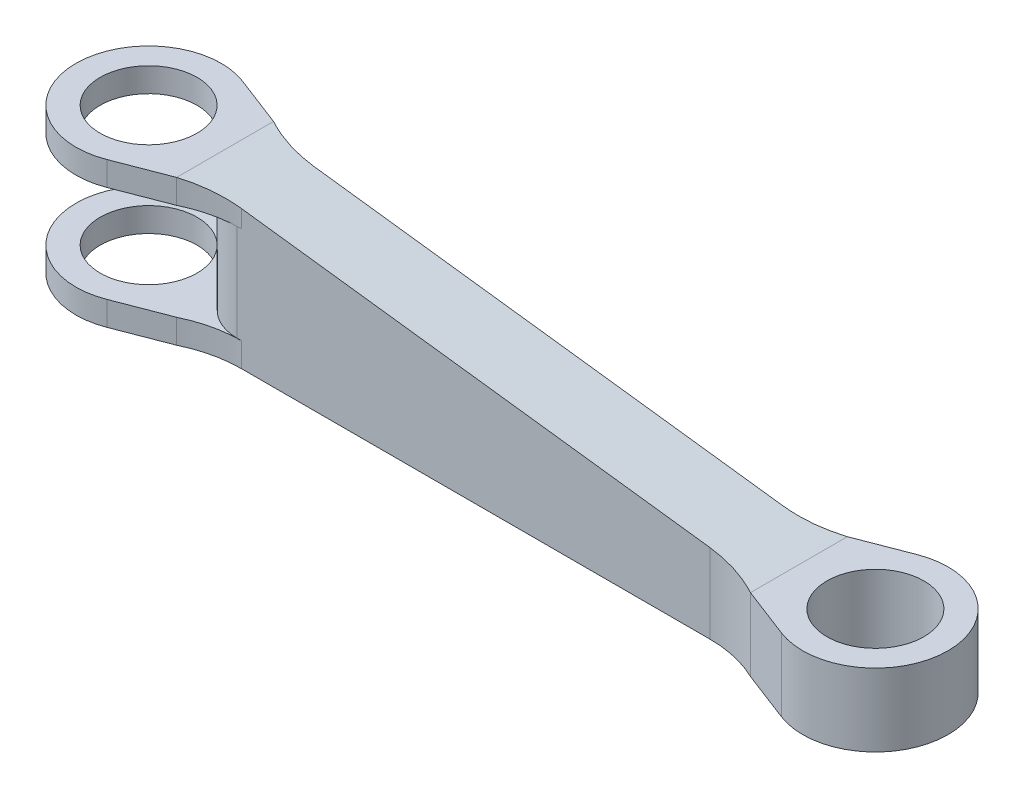
ISO-10303-21;
HEADER;
FILE_DESCRIPTION(('STEP AP214'),'2;1');
FILE_NAME('part.step','',(''),(''),'','','');
FILE_SCHEMA(('AUTOMOTIVE_DESIGN { 1 0 10303 214 1 1 1 1 }'));
ENDSEC;
DATA;
#1=APPLICATION_CONTEXT('core data for automotive mechanical design processes');
#2=APPLICATION_PROTOCOL_DEFINITION('international standard','automotive_design',2000,#1);
#3=PRODUCT_CONTEXT('',#1,'mechanical');
#4=PRODUCT('Part','Part','',(#3));
#5=PRODUCT_RELATED_PRODUCT_CATEGORY('part','',(#4));
#6=PRODUCT_DEFINITION_FORMATION('','',#4);
#7=PRODUCT_DEFINITION_CONTEXT('part definition',#1,'design');
#8=PRODUCT_DEFINITION('design','',#6,#7);
#9=PRODUCT_DEFINITION_SHAPE('','',#8);
#10=(LENGTH_UNIT() NAMED_UNIT(*) SI_UNIT(.MILLI.,.METRE.));
#11=(NAMED_UNIT(*) PLANE_ANGLE_UNIT() SI_UNIT($,.RADIAN.));
#12=(NAMED_UNIT(*) SI_UNIT($,.STERADIAN.) SOLID_ANGLE_UNIT());
#13=UNCERTAINTY_MEASURE_WITH_UNIT(LENGTH_MEASURE(1.E-05),#10,'distance_accuracy_value','');
#14=(GEOMETRIC_REPRESENTATION_CONTEXT(3) GLOBAL_UNCERTAINTY_ASSIGNED_CONTEXT((#13)) GLOBAL_UNIT_ASSIGNED_CONTEXT((#10,
#11,#12)) REPRESENTATION_CONTEXT('',''));
#15=CARTESIAN_POINT('',(0.,0.,0.));
#16=DIRECTION('',(0.,0.,1.));
#17=DIRECTION('',(1.,0.,0.));
#18=AXIS2_PLACEMENT_3D('',#15,#16,#17);
#19=CARTESIAN_POINT('',(0.,7.62,0.));
#20=DIRECTION('',(0.,-1.,0.));
#21=DIRECTION('',(0.,0.,-1.));
#22=AXIS2_PLACEMENT_3D('',#19,#20,#21);
#23=CYLINDRICAL_SURFACE('',#22,7.62);
#24=CARTESIAN_POINT('',(0.,-5.08,0.));
#25=DIRECTION('',(0.,-1.,0.));
#26=DIRECTION('',(0.,0.,-1.));
#27=AXIS2_PLACEMENT_3D('',#24,#25,#26);
#28=CIRCLE('',#27,7.62);
#29=CARTESIAN_POINT('',(2.73566372202433,-5.08,7.112));
#30=VERTEX_POINT('',#29);
#31=CARTESIAN_POINT('',(2.73566372202433,-5.08,-7.112));
#32=VERTEX_POINT('',#31);
#33=EDGE_CURVE('E184',#30,#32,#28,.T.);
#34=ORIENTED_EDGE('',*,*,#33,.T.);
#35=DIRECTION('',(0.,-1.,0.));
#36=VECTOR('',#35,1.);
#37=CARTESIAN_POINT('',(2.73566372202433,7.62,-7.112));
#38=LINE('',#37,#36);
#39=CARTESIAN_POINT('',(2.73566372202433,-7.62,-7.112));
#40=VERTEX_POINT('',#39);
#41=EDGE_CURVE('E338',#32,#40,#38,.T.);
#42=ORIENTED_EDGE('',*,*,#41,.T.);
#43=CARTESIAN_POINT('',(0.,-7.62,0.));
#44=DIRECTION('',(0.,1.,0.));
#45=DIRECTION('',(0.,0.,1.));
#46=AXIS2_PLACEMENT_3D('',#43,#44,#45);
#47=CIRCLE('',#46,7.62);
#48=CARTESIAN_POINT('',(2.73566372202433,-7.62,7.112));
#49=VERTEX_POINT('',#48);
#50=EDGE_CURVE('E333',#40,#49,#47,.T.);
#51=ORIENTED_EDGE('',*,*,#50,.T.);
#52=DIRECTION('',(0.,-1.,0.));
#53=VECTOR('',#52,1.);
#54=CARTESIAN_POINT('',(2.73566372202433,7.62,7.112));
#55=LINE('',#54,#53);
#56=EDGE_CURVE('E321',#30,#49,#55,.T.);
#57=ORIENTED_EDGE('',*,*,#56,.F.);
#58=EDGE_LOOP('',(#34,#42,#51,#57));
#59=FACE_BOUND('',#58,.T.);
#60=ADVANCED_FACE('F35',(#59),#23,.T.);
#61=CARTESIAN_POINT('',(2.73566372202433,7.62,7.112));
#62=DIRECTION('',(-0.359010987142301,0.,-0.933333333333333));
#63=DIRECTION('',(-0.933333333333333,0.,0.359010987142301));
#64=AXIS2_PLACEMENT_3D('',#61,#62,#63);
#65=PLANE('',#64);
#66=CARTESIAN_POINT('',(2.73566372202433,7.62,7.112));
#67=VERTEX_POINT('',#66);
#68=CARTESIAN_POINT('',(2.73566372202433,5.08,7.112));
#69=VERTEX_POINT('',#68);
#70=EDGE_CURVE('E256',#67,#69,#55,.T.);
#71=ORIENTED_EDGE('',*,*,#70,.T.);
#72=DIRECTION('',(0.933333333333333,0.,-0.359010987142301));
#73=VECTOR('',#72,1.);
#74=CARTESIAN_POINT('',(2.73566372202433,5.08,7.112));
#75=LINE('',#74,#73);
#76=CARTESIAN_POINT('',(8.01832470248509,5.08,5.08));
#77=VERTEX_POINT('',#76);
#78=EDGE_CURVE('E390',#69,#77,#75,.T.);
#79=ORIENTED_EDGE('',*,*,#78,.T.);
#80=DIRECTION('',(0.,-1.,0.));
#81=VECTOR('',#80,1.);
#82=CARTESIAN_POINT('',(8.01832470248509,7.62,5.08));
#83=LINE('',#82,#81);
#84=CARTESIAN_POINT('',(8.01832470248509,7.62,5.08));
#85=VERTEX_POINT('',#84);
#86=EDGE_CURVE('E196',#85,#77,#83,.T.);
#87=ORIENTED_EDGE('',*,*,#86,.F.);
#88=DIRECTION('',(0.933333333333333,0.,-0.359010987142301));
#89=VECTOR('',#88,1.);
#90=CARTESIAN_POINT('',(2.73566372202433,7.62,7.112));
#91=LINE('',#90,#89);
#92=EDGE_CURVE('E365',#67,#85,#91,.T.);
#93=ORIENTED_EDGE('',*,*,#92,.F.);
#94=EDGE_LOOP('',(#71,#79,#87,#93));
#95=FACE_BOUND('',#94,.T.);
#96=ADVANCED_FACE('F409',(#95),#65,.F.);
#97=CARTESIAN_POINT('',(2.73566372202433,7.62,-7.112));
#98=DIRECTION('',(-0.359010987142301,0.,0.933333333333333));
#99=DIRECTION('',(0.933333333333333,0.,0.359010987142301));
#100=AXIS2_PLACEMENT_3D('',#97,#98,#99);
#101=PLANE('',#100);
#102=DIRECTION('',(0.,-1.,0.));
#103=VECTOR('',#102,1.);
#104=CARTESIAN_POINT('',(8.01832470248509,7.62,-5.08));
#105=LINE('',#104,#103);
#106=CARTESIAN_POINT('',(8.01832470248509,7.62,-5.08));
#107=VERTEX_POINT('',#106);
#108=CARTESIAN_POINT('',(8.01832470248509,5.08,-5.08));
#109=VERTEX_POINT('',#108);
#110=EDGE_CURVE('E299',#107,#109,#105,.T.);
#111=ORIENTED_EDGE('',*,*,#110,.T.);
#112=DIRECTION('',(-0.933333333333333,0.,-0.359010987142301));
#113=VECTOR('',#112,1.);
#114=CARTESIAN_POINT('',(2.73566372202433,5.08,-7.112));
#115=LINE('',#114,#113);
#116=CARTESIAN_POINT('',(2.73566372202433,5.08,-7.112));
#117=VERTEX_POINT('',#116);
#118=EDGE_CURVE('E251',#109,#117,#115,.T.);
#119=ORIENTED_EDGE('',*,*,#118,.T.);
#120=CARTESIAN_POINT('',(2.73566372202433,7.62,-7.112));
#121=VERTEX_POINT('',#120);
#122=EDGE_CURVE('E312',#121,#117,#38,.T.);
#123=ORIENTED_EDGE('',*,*,#122,.F.);
#124=DIRECTION('',(-0.933333333333333,0.,-0.359010987142301));
#125=VECTOR('',#124,1.);
#126=CARTESIAN_POINT('',(2.73566372202433,7.62,-7.112));
#127=LINE('',#126,#125);
#128=EDGE_CURVE('E346',#107,#121,#127,.T.);
#129=ORIENTED_EDGE('',*,*,#128,.F.);
#130=EDGE_LOOP('',(#111,#119,#123,#129));
#131=FACE_BOUND('',#130,.T.);
#132=ADVANCED_FACE('F403',(#131),#101,.F.);
#133=CARTESIAN_POINT('',(0.,7.62,0.));
#134=DIRECTION('',(0.,-1.,0.));
#135=DIRECTION('',(0.,0.,-1.));
#136=AXIS2_PLACEMENT_3D('',#133,#134,#135);
#137=CYLINDRICAL_SURFACE('',#136,5.08);
#138=CARTESIAN_POINT('',(0.,5.08,0.));
#139=DIRECTION('',(0.,1.,0.));
#140=DIRECTION('',(0.,0.,1.));
#141=AXIS2_PLACEMENT_3D('',#138,#139,#140);
#142=CIRCLE('',#141,5.08);
#143=CARTESIAN_POINT('',(0.,5.08,-5.08));
#144=VERTEX_POINT('',#143);
#145=EDGE_CURVE('E187',#144,#144,#142,.T.);
#146=CARTESIAN_POINT('',(0.,7.62,0.));
#147=DIRECTION('',(0.,1.,0.));
#148=DIRECTION('',(0.,0.,1.));
#149=AXIS2_PLACEMENT_3D('',#146,#147,#148);
#150=CIRCLE('',#149,5.08);
#151=CARTESIAN_POINT('',(0.,7.62,-5.08));
#152=VERTEX_POINT('',#151);
#153=EDGE_CURVE('E340',#152,#152,#150,.T.);
#154=CARTESIAN_POINT('',(0.,5.08,-5.08));
#155=CARTESIAN_POINT('',(0.,5.10645833333333,-5.08));
#156=CARTESIAN_POINT('',(0.,5.13291666666667,-5.08));
#157=CARTESIAN_POINT('',(0.,5.18583333333333,-5.08));
#158=CARTESIAN_POINT('',(0.,5.21229166666667,-5.08));
#159=CARTESIAN_POINT('',(0.,5.26520833333333,-5.08));
#160=CARTESIAN_POINT('',(0.,5.29166666666667,-5.08));
#161=CARTESIAN_POINT('',(0.,5.34458333333333,-5.08));
#162=CARTESIAN_POINT('',(0.,5.37104166666667,-5.08));
#163=CARTESIAN_POINT('',(0.,5.42395833333333,-5.08));
#164=CARTESIAN_POINT('',(0.,5.45041666666667,-5.08));
#165=CARTESIAN_POINT('',(0.,5.50333333333333,-5.08));
#166=CARTESIAN_POINT('',(0.,5.52979166666667,-5.08));
#167=CARTESIAN_POINT('',(0.,5.58270833333333,-5.08));
#168=CARTESIAN_POINT('',(0.,5.60916666666667,-5.08));
#169=CARTESIAN_POINT('',(0.,5.66208333333333,-5.08));
#170=CARTESIAN_POINT('',(0.,5.68854166666667,-5.08));
#171=CARTESIAN_POINT('',(0.,5.74145833333333,-5.08));
#172=CARTESIAN_POINT('',(0.,5.76791666666667,-5.08));
#173=CARTESIAN_POINT('',(0.,5.82083333333333,-5.08));
#174=CARTESIAN_POINT('',(0.,5.84729166666667,-5.08));
#175=CARTESIAN_POINT('',(0.,5.90020833333333,-5.08));
#176=CARTESIAN_POINT('',(0.,5.92666666666667,-5.08));
#177=CARTESIAN_POINT('',(0.,5.97958333333333,-5.08));
#178=CARTESIAN_POINT('',(0.,6.00604166666667,-5.08));
#179=CARTESIAN_POINT('',(0.,6.05895833333333,-5.08));
#180=CARTESIAN_POINT('',(0.,6.08541666666667,-5.08));
#181=CARTESIAN_POINT('',(0.,6.13833333333333,-5.08));
#182=CARTESIAN_POINT('',(0.,6.16479166666667,-5.08));
#183=CARTESIAN_POINT('',(0.,6.21770833333333,-5.08));
#184=CARTESIAN_POINT('',(0.,6.24416666666667,-5.08));
#185=CARTESIAN_POINT('',(0.,6.29708333333333,-5.08));
#186=CARTESIAN_POINT('',(0.,6.32354166666667,-5.08));
#187=CARTESIAN_POINT('',(0.,6.37645833333333,-5.08));
#188=CARTESIAN_POINT('',(0.,6.40291666666667,-5.08));
#189=CARTESIAN_POINT('',(0.,6.45583333333333,-5.08));
#190=CARTESIAN_POINT('',(0.,6.48229166666667,-5.08));
#191=CARTESIAN_POINT('',(0.,6.53520833333333,-5.08));
#192=CARTESIAN_POINT('',(0.,6.56166666666667,-5.08));
#193=CARTESIAN_POINT('',(0.,6.61458333333333,-5.08));
#194=CARTESIAN_POINT('',(0.,6.64104166666667,-5.08));
#195=CARTESIAN_POINT('',(0.,6.69395833333333,-5.08));
#196=CARTESIAN_POINT('',(0.,6.72041666666667,-5.08));
#197=CARTESIAN_POINT('',(0.,6.77333333333333,-5.08));
#198=CARTESIAN_POINT('',(0.,6.79979166666667,-5.08));
#199=CARTESIAN_POINT('',(0.,6.85270833333333,-5.08));
#200=CARTESIAN_POINT('',(0.,6.87916666666667,-5.08));
#201=CARTESIAN_POINT('',(0.,6.93208333333333,-5.08));
#202=CARTESIAN_POINT('',(0.,6.95854166666667,-5.08));
#203=CARTESIAN_POINT('',(0.,7.01145833333333,-5.08));
#204=CARTESIAN_POINT('',(0.,7.03791666666667,-5.08));
#205=CARTESIAN_POINT('',(0.,7.09083333333333,-5.08));
#206=CARTESIAN_POINT('',(0.,7.11729166666667,-5.08));
#207=CARTESIAN_POINT('',(0.,7.17020833333333,-5.08));
#208=CARTESIAN_POINT('',(0.,7.19666666666667,-5.08));
#209=CARTESIAN_POINT('',(0.,7.24958333333333,-5.08));
#210=CARTESIAN_POINT('',(0.,7.27604166666667,-5.08));
#211=CARTESIAN_POINT('',(0.,7.32895833333333,-5.08));
#212=CARTESIAN_POINT('',(0.,7.35541666666667,-5.08));
#213=CARTESIAN_POINT('',(0.,7.40833333333333,-5.08));
#214=CARTESIAN_POINT('',(0.,7.43479166666667,-5.08));
#215=CARTESIAN_POINT('',(0.,7.48770833333333,-5.08));
#216=CARTESIAN_POINT('',(0.,7.51416666666667,-5.08));
#217=CARTESIAN_POINT('',(0.,7.56708333333333,-5.08));
#218=CARTESIAN_POINT('',(0.,7.59354166666667,-5.08));
#219=CARTESIAN_POINT('',(0.,7.62,-5.08));
#220=B_SPLINE_CURVE_WITH_KNOTS('',3,(#154,#155,#156,#157,#158,#159,#160,#161,#162,#163,#164,
#165,#166,#167,#168,#169,#170,#171,#172,#173,#174,#175,#176,#177,#178,#179,#180,#181,#182,#183,
#184,#185,#186,#187,#188,#189,#190,#191,#192,#193,#194,#195,#196,#197,#198,#199,#200,#201,#202,
#203,#204,#205,#206,#207,#208,#209,#210,#211,#212,#213,#214,#215,#216,#217,#218,#219),
.UNSPECIFIED.,.F.,.F.,(4,2,2,2,2,2,2,2,2,2,2,2,2,2,2,2,2,2,2,2,2,2,2,2,2,2,2,2,2,2,2,2,4),(0.,
0.0793749999999996,0.158749999999999,0.238125,0.3175,0.396875,0.476249999999999,0.555625,
0.634999999999999,0.714375,0.793749999999999,0.873125,0.952499999999999,1.031875,1.11125,
1.190625,1.27,1.349375,1.42875,1.508125,1.5875,1.666875,1.74625,1.825625,1.905,1.984375,2.06375,
2.143125,2.2225,2.301875,2.38125,2.460625,2.54),.UNSPECIFIED.);
#221=EDGE_CURVE('BSEAM462',#144,#152,#220,.T.);
#222=ORIENTED_EDGE('',*,*,#145,.F.);
#223=ORIENTED_EDGE('',*,*,#153,.T.);
#224=ORIENTED_EDGE('',*,*,#221,.T.);
#225=ORIENTED_EDGE('',*,*,#221,.F.);
#226=EDGE_LOOP('',(#222,#224,#223,#225));
#227=FACE_BOUND('',#226,.T.);
#228=ADVANCED_FACE('F462',(#227),#137,.F.);
#229=CARTESIAN_POINT('',(0.,7.62,0.));
#230=DIRECTION('',(0.,1.,0.));
#231=DIRECTION('',(0.,0.,1.));
#232=AXIS2_PLACEMENT_3D('',#229,#230,#231);
#233=PLANE('',#232);
#234=DIRECTION('',(0.,0.,1.));
#235=VECTOR('',#234,1.);
#236=CARTESIAN_POINT('',(8.01832470248509,7.62,-7.62));
#237=LINE('',#236,#235);
#238=EDGE_CURVE('E292',#107,#85,#237,.T.);
#239=ORIENTED_EDGE('',*,*,#238,.F.);
#240=ORIENTED_EDGE('',*,*,#128,.T.);
#241=CARTESIAN_POINT('',(0.,7.62,0.));
#242=DIRECTION('',(0.,1.,0.));
#243=DIRECTION('',(0.,0.,1.));
#244=AXIS2_PLACEMENT_3D('',#241,#242,#243);
#245=CIRCLE('',#244,7.62);
#246=EDGE_CURVE('E362',#121,#67,#245,.T.);
#247=ORIENTED_EDGE('',*,*,#246,.T.);
#248=ORIENTED_EDGE('',*,*,#92,.T.);
#249=EDGE_LOOP('',(#239,#240,#247,#248));
#250=FACE_BOUND('',#249,.T.);
#251=ORIENTED_EDGE('',*,*,#153,.F.);
#252=EDGE_LOOP('',(#251));
#253=FACE_BOUND('',#252,.T.);
#254=ADVANCED_FACE('F401',(#250,#253),#233,.T.);
#255=CARTESIAN_POINT('',(0.,-7.62,0.));
#256=DIRECTION('',(0.,1.,0.));
#257=DIRECTION('',(0.,0.,1.));
#258=AXIS2_PLACEMENT_3D('',#255,#256,#257);
#259=PLANE('',#258);
#260=CARTESIAN_POINT('',(0.,-7.62,0.));
#261=DIRECTION('',(0.,1.,0.));
#262=DIRECTION('',(0.,0.,1.));
#263=AXIS2_PLACEMENT_3D('',#260,#261,#262);
#264=CIRCLE('',#263,5.08);
#265=CARTESIAN_POINT('',(0.,-7.62,-5.08));
#266=VERTEX_POINT('',#265);
#267=EDGE_CURVE('E343',#266,#266,#264,.T.);
#268=ORIENTED_EDGE('',*,*,#267,.T.);
#269=EDGE_LOOP('',(#268));
#270=FACE_BOUND('',#269,.T.);
#271=ORIENTED_EDGE('',*,*,#50,.F.);
#272=DIRECTION('',(-0.933333333333333,0.,-0.359010987142301));
#273=VECTOR('',#272,1.);
#274=CARTESIAN_POINT('',(2.73566372202433,-7.62,-7.112));
#275=LINE('',#274,#273);
#276=CARTESIAN_POINT('',(8.01832470248509,-7.62,-5.08));
#277=VERTEX_POINT('',#276);
#278=EDGE_CURVE('E361',#277,#40,#275,.T.);
#279=ORIENTED_EDGE('',*,*,#278,.F.);
#280=CARTESIAN_POINT('',(13.5541263607818,-7.62,-16.51));
#281=DIRECTION('',(0.,1.,0.));
#282=DIRECTION('',(0.,0.,1.));
#283=AXIS2_PLACEMENT_3D('',#280,#281,#282);
#284=CIRCLE('',#283,12.7);
#285=CARTESIAN_POINT('',(13.5541263607818,-7.62,-3.81));
#286=VERTEX_POINT('',#285);
#287=EDGE_CURVE('E280',#277,#286,#284,.T.);
#288=ORIENTED_EDGE('',*,*,#287,.T.);
#289=DIRECTION('',(-1.,0.,0.));
#290=VECTOR('',#289,1.);
#291=CARTESIAN_POINT('',(8.01832470248509,-7.62,-3.81));
#292=LINE('',#291,#290);
#293=CARTESIAN_POINT('',(62.6458736392183,-7.62,-3.81));
#294=VERTEX_POINT('',#293);
#295=EDGE_CURVE('E360',#294,#286,#292,.T.);
#296=ORIENTED_EDGE('',*,*,#295,.F.);
#297=CARTESIAN_POINT('',(62.6458736392183,-7.62,-16.51));
#298=DIRECTION('',(0.,1.,0.));
#299=DIRECTION('',(0.,0.,1.));
#300=AXIS2_PLACEMENT_3D('',#297,#298,#299);
#301=CIRCLE('',#300,12.7);
#302=CARTESIAN_POINT('',(68.1816752975149,-7.62,-5.08));
#303=VERTEX_POINT('',#302);
#304=EDGE_CURVE('E276',#294,#303,#301,.T.);
#305=ORIENTED_EDGE('',*,*,#304,.T.);
#306=DIRECTION('',(-0.933333333333333,0.,0.359010987142301));
#307=VECTOR('',#306,1.);
#308=CARTESIAN_POINT('',(68.1816752975149,-7.62,-5.08));
#309=LINE('',#308,#307);
#310=CARTESIAN_POINT('',(73.4643362779757,-7.62,-7.112));
#311=VERTEX_POINT('',#310);
#312=EDGE_CURVE('E357',#311,#303,#309,.T.);
#313=ORIENTED_EDGE('',*,*,#312,.F.);
#314=CARTESIAN_POINT('',(76.2,-7.62,0.));
#315=DIRECTION('',(0.,1.,0.));
#316=DIRECTION('',(0.,0.,-1.));
#317=AXIS2_PLACEMENT_3D('',#314,#315,#316);
#318=CIRCLE('',#317,7.62);
#319=CARTESIAN_POINT('',(73.4643362779757,-7.62,7.112));
#320=VERTEX_POINT('',#319);
#321=EDGE_CURVE('E354',#320,#311,#318,.T.);
#322=ORIENTED_EDGE('',*,*,#321,.F.);
#323=DIRECTION('',(0.933333333333333,0.,0.359010987142301));
#324=VECTOR('',#323,1.);
#325=CARTESIAN_POINT('',(68.1816752975149,-7.62,5.08));
#326=LINE('',#325,#324);
#327=CARTESIAN_POINT('',(68.1816752975149,-7.62,5.08));
#328=VERTEX_POINT('',#327);
#329=EDGE_CURVE('E351',#328,#320,#326,.T.);
#330=ORIENTED_EDGE('',*,*,#329,.F.);
#331=CARTESIAN_POINT('',(62.6458736392183,-7.62,16.51));
#332=DIRECTION('',(0.,1.,0.));
#333=DIRECTION('',(0.,0.,1.));
#334=AXIS2_PLACEMENT_3D('',#331,#332,#333);
#335=CIRCLE('',#334,12.7);
#336=CARTESIAN_POINT('',(62.6458736392183,-7.62,3.81));
#337=VERTEX_POINT('',#336);
#338=EDGE_CURVE('E271',#328,#337,#335,.T.);
#339=ORIENTED_EDGE('',*,*,#338,.T.);
#340=DIRECTION('',(1.,0.,0.));
#341=VECTOR('',#340,1.);
#342=CARTESIAN_POINT('',(8.01832470248509,-7.62,3.81));
#343=LINE('',#342,#341);
#344=CARTESIAN_POINT('',(13.5541263607817,-7.62,3.81));
#345=VERTEX_POINT('',#344);
#346=EDGE_CURVE('E335',#345,#337,#343,.T.);
#347=ORIENTED_EDGE('',*,*,#346,.F.);
#348=CARTESIAN_POINT('',(13.5541263607817,-7.62,16.51));
#349=DIRECTION('',(0.,1.,0.));
#350=DIRECTION('',(0.,0.,1.));
#351=AXIS2_PLACEMENT_3D('',#348,#349,#350);
#352=CIRCLE('',#351,12.7);
#353=CARTESIAN_POINT('',(8.01832470248509,-7.62,5.08));
#354=VERTEX_POINT('',#353);
#355=EDGE_CURVE('E203',#345,#354,#352,.T.);
#356=ORIENTED_EDGE('',*,*,#355,.T.);
#357=DIRECTION('',(0.933333333333333,0.,-0.359010987142301));
#358=VECTOR('',#357,1.);
#359=CARTESIAN_POINT('',(2.73566372202433,-7.62,7.112));
#360=LINE('',#359,#358);
#361=EDGE_CURVE('E194',#49,#354,#360,.T.);
#362=ORIENTED_EDGE('',*,*,#361,.F.);
#363=EDGE_LOOP('',(#271,#279,#288,#296,#305,#313,#322,#330,#339,#347,#356,#362));
#364=FACE_BOUND('',#363,.T.);
#365=CARTESIAN_POINT('',(76.2,-7.62,0.));
#366=DIRECTION('',(0.,1.,0.));
#367=DIRECTION('',(0.,0.,1.));
#368=AXIS2_PLACEMENT_3D('',#365,#366,#367);
#369=CIRCLE('',#368,5.08);
#370=CARTESIAN_POINT('',(76.2,-7.62,-5.08));
#371=VERTEX_POINT('',#370);
#372=EDGE_CURVE('E371',#371,#371,#369,.T.);
#373=ORIENTED_EDGE('',*,*,#372,.T.);
#374=EDGE_LOOP('',(#373));
#375=FACE_BOUND('',#374,.T.);
#376=ADVANCED_FACE('F330',(#270,#364,#375),#259,.F.);
#377=ORIENTED_EDGE('',*,*,#122,.T.);
#378=CARTESIAN_POINT('',(0.,5.08,0.));
#379=DIRECTION('',(0.,1.,0.));
#380=DIRECTION('',(0.,0.,1.));
#381=AXIS2_PLACEMENT_3D('',#378,#379,#380);
#382=CIRCLE('',#381,7.62);
#383=EDGE_CURVE('E393',#117,#69,#382,.T.);
#384=ORIENTED_EDGE('',*,*,#383,.T.);
#385=ORIENTED_EDGE('',*,*,#70,.F.);
#386=ORIENTED_EDGE('',*,*,#246,.F.);
#387=EDGE_LOOP('',(#377,#384,#385,#386));
#388=FACE_BOUND('',#387,.T.);
#389=ADVANCED_FACE('F405',(#388),#23,.T.);
#390=CARTESIAN_POINT('',(8.01832470248509,-5.08,5.08));
#391=VERTEX_POINT('',#390);
#392=EDGE_CURVE('E191',#391,#354,#83,.T.);
#393=ORIENTED_EDGE('',*,*,#392,.F.);
#394=DIRECTION('',(-0.933333333333333,0.,0.359010987142301));
#395=VECTOR('',#394,1.);
#396=CARTESIAN_POINT('',(2.73566372202433,-5.08,7.112));
#397=LINE('',#396,#395);
#398=EDGE_CURVE('E177',#391,#30,#397,.T.);
#399=ORIENTED_EDGE('',*,*,#398,.T.);
#400=ORIENTED_EDGE('',*,*,#56,.T.);
#401=ORIENTED_EDGE('',*,*,#361,.T.);
#402=EDGE_LOOP('',(#393,#399,#400,#401));
#403=FACE_BOUND('',#402,.T.);
#404=ADVANCED_FACE('F192',(#403),#65,.F.);
#405=CARTESIAN_POINT('',(8.01832470248509,7.62,3.81));
#406=DIRECTION('',(0.,0.,-1.));
#407=DIRECTION('',(-1.,0.,0.));
#408=AXIS2_PLACEMENT_3D('',#405,#406,#407);
#409=PLANE('',#408);
#410=DIRECTION('',(-1.,0.,0.));
#411=VECTOR('',#410,1.);
#412=CARTESIAN_POINT('',(-7.62,5.08,3.81));
#413=LINE('',#412,#411);
#414=CARTESIAN_POINT('',(13.5541263607817,5.08,3.81));
#415=VERTEX_POINT('',#414);
#416=CARTESIAN_POINT('',(13.0983247024851,5.08,3.81));
#417=VERTEX_POINT('',#416);
#418=EDGE_CURVE('E252',#415,#417,#413,.T.);
#419=ORIENTED_EDGE('',*,*,#418,.T.);
#420=DIRECTION('',(0.,-1.,0.));
#421=VECTOR('',#420,1.);
#422=CARTESIAN_POINT('',(13.0983247024851,7.62,3.81));
#423=LINE('',#422,#421);
#424=CARTESIAN_POINT('',(13.0983247024851,-5.08,3.81));
#425=VERTEX_POINT('',#424);
#426=EDGE_CURVE('E215',#417,#425,#423,.T.);
#427=ORIENTED_EDGE('',*,*,#426,.T.);
#428=DIRECTION('',(1.,0.,0.));
#429=VECTOR('',#428,1.);
#430=CARTESIAN_POINT('',(-7.62,-5.08,3.81));
#431=LINE('',#430,#429);
#432=CARTESIAN_POINT('',(13.5541263607817,-5.08,3.81));
#433=VERTEX_POINT('',#432);
#434=EDGE_CURVE('E259',#425,#433,#431,.T.);
#435=ORIENTED_EDGE('',*,*,#434,.T.);
#436=DIRECTION('',(0.,-1.,0.));
#437=VECTOR('',#436,1.);
#438=CARTESIAN_POINT('',(13.5541263607817,7.62,3.81));
#439=LINE('',#438,#437);
#440=EDGE_CURVE('E201',#433,#345,#439,.T.);
#441=ORIENTED_EDGE('',*,*,#440,.T.);
#442=ORIENTED_EDGE('',*,*,#346,.T.);
#443=DIRECTION('',(0.,1.,0.));
#444=VECTOR('',#443,1.);
#445=CARTESIAN_POINT('',(62.6458736392183,7.62,3.81));
#446=LINE('',#445,#444);
#447=CARTESIAN_POINT('',(62.6458736392183,0.701137955566348,3.81));
#448=VERTEX_POINT('',#447);
#449=EDGE_CURVE('E262',#337,#448,#446,.T.);
#450=ORIENTED_EDGE('',*,*,#449,.T.);
#451=DIRECTION('',(-0.9920744596049,0.125651369270877,0.));
#452=VECTOR('',#451,1.);
#453=CARTESIAN_POINT('',(8.01832470248509,7.62,3.81));
#454=LINE('',#453,#452);
#455=CARTESIAN_POINT('',(13.5541263607817,6.91886204443365,3.81));
#456=VERTEX_POINT('',#455);
#457=EDGE_CURVE('E375',#448,#456,#454,.T.);
#458=ORIENTED_EDGE('',*,*,#457,.T.);
#459=DIRECTION('',(0.,-1.,0.));
#460=VECTOR('',#459,1.);
#461=CARTESIAN_POINT('',(13.5541263607817,7.62,3.81));
#462=LINE('',#461,#460);
#463=EDGE_CURVE('E255',#456,#415,#462,.T.);
#464=ORIENTED_EDGE('',*,*,#463,.T.);
#465=EDGE_LOOP('',(#419,#427,#435,#441,#442,#450,#458,#464));
#466=FACE_BOUND('',#465,.T.);
#467=ADVANCED_FACE('F417',(#466),#409,.F.);
#468=CARTESIAN_POINT('',(68.1816752975149,7.62,5.08));
#469=DIRECTION('',(0.359010987142301,0.,-0.933333333333333));
#470=DIRECTION('',(-0.933333333333333,0.,-0.359010987142301));
#471=AXIS2_PLACEMENT_3D('',#468,#469,#470);
#472=PLANE('',#471);
#473=DIRECTION('',(0.,-1.,0.));
#474=VECTOR('',#473,1.);
#475=CARTESIAN_POINT('',(73.4643362779757,7.62,7.112));
#476=LINE('',#475,#474);
#477=CARTESIAN_POINT('',(73.4643362779757,0.,7.112));
#478=VERTEX_POINT('',#477);
#479=EDGE_CURVE('E317',#478,#320,#476,.T.);
#480=ORIENTED_EDGE('',*,*,#479,.F.);
#481=DIRECTION('',(-0.933333333333333,0.,-0.359010987142301));
#482=VECTOR('',#481,1.);
#483=CARTESIAN_POINT('',(68.1816752975149,0.,5.08));
#484=LINE('',#483,#482);
#485=CARTESIAN_POINT('',(68.1816752975149,0.,5.08));
#486=VERTEX_POINT('',#485);
#487=EDGE_CURVE('E379',#478,#486,#484,.T.);
#488=ORIENTED_EDGE('',*,*,#487,.T.);
#489=DIRECTION('',(0.,-1.,0.));
#490=VECTOR('',#489,1.);
#491=CARTESIAN_POINT('',(68.1816752975149,7.62,5.08));
#492=LINE('',#491,#490);
#493=EDGE_CURVE('E197',#486,#328,#492,.T.);
#494=ORIENTED_EDGE('',*,*,#493,.T.);
#495=ORIENTED_EDGE('',*,*,#329,.T.);
#496=EDGE_LOOP('',(#480,#488,#494,#495));
#497=FACE_BOUND('',#496,.T.);
#498=ADVANCED_FACE('F476',(#497),#472,.F.);
#499=CARTESIAN_POINT('',(76.2,7.62,0.));
#500=DIRECTION('',(0.,-1.,0.));
#501=DIRECTION('',(0.,0.,-1.));
#502=AXIS2_PLACEMENT_3D('',#499,#500,#501);
#503=CYLINDRICAL_SURFACE('',#502,7.62);
#504=DIRECTION('',(0.,-1.,0.));
#505=VECTOR('',#504,1.);
#506=CARTESIAN_POINT('',(73.4643362779757,7.62,-7.112));
#507=LINE('',#506,#505);
#508=CARTESIAN_POINT('',(73.4643362779757,0.,-7.112));
#509=VERTEX_POINT('',#508);
#510=EDGE_CURVE('E309',#509,#311,#507,.T.);
#511=ORIENTED_EDGE('',*,*,#510,.F.);
#512=CARTESIAN_POINT('',(76.2,0.,0.));
#513=DIRECTION('',(0.,-1.,0.));
#514=DIRECTION('',(0.,0.,-1.));
#515=AXIS2_PLACEMENT_3D('',#512,#513,#514);
#516=CIRCLE('',#515,7.62);
#517=EDGE_CURVE('E382',#509,#478,#516,.T.);
#518=ORIENTED_EDGE('',*,*,#517,.T.);
#519=ORIENTED_EDGE('',*,*,#479,.T.);
#520=ORIENTED_EDGE('',*,*,#321,.T.);
#521=EDGE_LOOP('',(#511,#518,#519,#520));
#522=FACE_BOUND('',#521,.T.);
#523=ADVANCED_FACE('F473',(#522),#503,.T.);
#524=CARTESIAN_POINT('',(68.1816752975149,7.62,-5.08));
#525=DIRECTION('',(0.359010987142301,0.,0.933333333333333));
#526=DIRECTION('',(0.933333333333333,0.,-0.359010987142301));
#527=AXIS2_PLACEMENT_3D('',#524,#525,#526);
#528=PLANE('',#527);
#529=DIRECTION('',(0.,-1.,0.));
#530=VECTOR('',#529,1.);
#531=CARTESIAN_POINT('',(68.1816752975149,7.62,-5.08));
#532=LINE('',#531,#530);
#533=CARTESIAN_POINT('',(68.1816752975149,0.,-5.08));
#534=VERTEX_POINT('',#533);
#535=EDGE_CURVE('E305',#534,#303,#532,.T.);
#536=ORIENTED_EDGE('',*,*,#535,.F.);
#537=DIRECTION('',(0.933333333333333,0.,-0.359010987142301));
#538=VECTOR('',#537,1.);
#539=CARTESIAN_POINT('',(68.1816752975149,0.,-5.08));
#540=LINE('',#539,#538);
#541=EDGE_CURVE('E385',#534,#509,#540,.T.);
#542=ORIENTED_EDGE('',*,*,#541,.T.);
#543=ORIENTED_EDGE('',*,*,#510,.T.);
#544=ORIENTED_EDGE('',*,*,#312,.T.);
#545=EDGE_LOOP('',(#536,#542,#543,#544));
#546=FACE_BOUND('',#545,.T.);
#547=ADVANCED_FACE('F429',(#546),#528,.F.);
#548=CARTESIAN_POINT('',(8.01832470248509,7.62,-3.81));
#549=DIRECTION('',(0.,0.,1.));
#550=DIRECTION('',(1.,0.,0.));
#551=AXIS2_PLACEMENT_3D('',#548,#549,#550);
#552=PLANE('',#551);
#553=DIRECTION('',(-1.,0.,0.));
#554=VECTOR('',#553,1.);
#555=CARTESIAN_POINT('',(-7.62,-5.08,-3.81));
#556=LINE('',#555,#554);
#557=CARTESIAN_POINT('',(13.5541263607818,-5.08,-3.81));
#558=VERTEX_POINT('',#557);
#559=CARTESIAN_POINT('',(13.0983247024851,-5.08,-3.81));
#560=VERTEX_POINT('',#559);
#561=EDGE_CURVE('E222',#558,#560,#556,.T.);
#562=ORIENTED_EDGE('',*,*,#561,.T.);
#563=DIRECTION('',(0.,1.,0.));
#564=VECTOR('',#563,1.);
#565=CARTESIAN_POINT('',(13.0983247024851,7.62,-3.81));
#566=LINE('',#565,#564);
#567=CARTESIAN_POINT('',(13.0983247024851,5.08,-3.81));
#568=VERTEX_POINT('',#567);
#569=EDGE_CURVE('E212',#560,#568,#566,.T.);
#570=ORIENTED_EDGE('',*,*,#569,.T.);
#571=DIRECTION('',(1.,0.,0.));
#572=VECTOR('',#571,1.);
#573=CARTESIAN_POINT('',(-7.62,5.08,-3.81));
#574=LINE('',#573,#572);
#575=CARTESIAN_POINT('',(13.5541263607818,5.08,-3.81));
#576=VERTEX_POINT('',#575);
#577=EDGE_CURVE('E233',#568,#576,#574,.T.);
#578=ORIENTED_EDGE('',*,*,#577,.T.);
#579=DIRECTION('',(0.,1.,0.));
#580=VECTOR('',#579,1.);
#581=CARTESIAN_POINT('',(13.5541263607818,7.62,-3.81));
#582=LINE('',#581,#580);
#583=CARTESIAN_POINT('',(13.5541263607818,6.91886204443365,-3.81));
#584=VERTEX_POINT('',#583);
#585=EDGE_CURVE('E264',#576,#584,#582,.T.);
#586=ORIENTED_EDGE('',*,*,#585,.T.);
#587=DIRECTION('',(0.9920744596049,-0.125651369270877,0.));
#588=VECTOR('',#587,1.);
#589=CARTESIAN_POINT('',(8.01832470248509,7.62,-3.81));
#590=LINE('',#589,#588);
#591=CARTESIAN_POINT('',(62.6458736392183,0.701137955566348,-3.81));
#592=VERTEX_POINT('',#591);
#593=EDGE_CURVE('E295',#584,#592,#590,.T.);
#594=ORIENTED_EDGE('',*,*,#593,.T.);
#595=DIRECTION('',(0.,-1.,0.));
#596=VECTOR('',#595,1.);
#597=CARTESIAN_POINT('',(62.6458736392183,7.62,-3.81));
#598=LINE('',#597,#596);
#599=EDGE_CURVE('E268',#592,#294,#598,.T.);
#600=ORIENTED_EDGE('',*,*,#599,.T.);
#601=ORIENTED_EDGE('',*,*,#295,.T.);
#602=DIRECTION('',(0.,1.,0.));
#603=VECTOR('',#602,1.);
#604=CARTESIAN_POINT('',(13.5541263607818,7.62,-3.81));
#605=LINE('',#604,#603);
#606=EDGE_CURVE('E231',#286,#558,#605,.T.);
#607=ORIENTED_EDGE('',*,*,#606,.T.);
#608=EDGE_LOOP('',(#562,#570,#578,#586,#594,#600,#601,#607));
#609=FACE_BOUND('',#608,.T.);
#610=ADVANCED_FACE('F228',(#609),#552,.F.);
#611=ORIENTED_EDGE('',*,*,#41,.F.);
#612=DIRECTION('',(0.933333333333333,0.,0.359010987142301));
#613=VECTOR('',#612,1.);
#614=CARTESIAN_POINT('',(2.73566372202433,-5.08,-7.112));
#615=LINE('',#614,#613);
#616=CARTESIAN_POINT('',(8.01832470248509,-5.08,-5.08));
#617=VERTEX_POINT('',#616);
#618=EDGE_CURVE('E239',#32,#617,#615,.T.);
#619=ORIENTED_EDGE('',*,*,#618,.T.);
#620=EDGE_CURVE('E306',#617,#277,#105,.T.);
#621=ORIENTED_EDGE('',*,*,#620,.T.);
#622=ORIENTED_EDGE('',*,*,#278,.T.);
#623=EDGE_LOOP('',(#611,#619,#621,#622));
#624=FACE_BOUND('',#623,.T.);
#625=ADVANCED_FACE('F398',(#624),#101,.F.);
#626=CARTESIAN_POINT('',(0.,-5.08,0.));
#627=DIRECTION('',(0.,-1.,0.));
#628=DIRECTION('',(0.,0.,-1.));
#629=AXIS2_PLACEMENT_3D('',#626,#627,#628);
#630=CIRCLE('',#629,5.08);
#631=CARTESIAN_POINT('',(0.,-5.08,-5.08));
#632=VERTEX_POINT('',#631);
#633=EDGE_CURVE('E237',#632,#632,#630,.T.);
#634=CARTESIAN_POINT('',(0.,-5.08,-5.08));
#635=CARTESIAN_POINT('',(0.,-5.10645833333333,-5.08));
#636=CARTESIAN_POINT('',(0.,-5.13291666666667,-5.08));
#637=CARTESIAN_POINT('',(0.,-5.18583333333333,-5.08));
#638=CARTESIAN_POINT('',(0.,-5.21229166666667,-5.08));
#639=CARTESIAN_POINT('',(0.,-5.26520833333333,-5.08));
#640=CARTESIAN_POINT('',(0.,-5.29166666666667,-5.08));
#641=CARTESIAN_POINT('',(0.,-5.34458333333333,-5.08));
#642=CARTESIAN_POINT('',(0.,-5.37104166666667,-5.08));
#643=CARTESIAN_POINT('',(0.,-5.42395833333333,-5.08));
#644=CARTESIAN_POINT('',(0.,-5.45041666666667,-5.08));
#645=CARTESIAN_POINT('',(0.,-5.50333333333333,-5.08));
#646=CARTESIAN_POINT('',(0.,-5.52979166666667,-5.08));
#647=CARTESIAN_POINT('',(0.,-5.58270833333333,-5.08));
#648=CARTESIAN_POINT('',(0.,-5.60916666666667,-5.08));
#649=CARTESIAN_POINT('',(0.,-5.66208333333333,-5.08));
#650=CARTESIAN_POINT('',(0.,-5.68854166666667,-5.08));
#651=CARTESIAN_POINT('',(0.,-5.74145833333333,-5.08));
#652=CARTESIAN_POINT('',(0.,-5.76791666666667,-5.08));
#653=CARTESIAN_POINT('',(0.,-5.82083333333333,-5.08));
#654=CARTESIAN_POINT('',(0.,-5.84729166666667,-5.08));
#655=CARTESIAN_POINT('',(0.,-5.90020833333333,-5.08));
#656=CARTESIAN_POINT('',(0.,-5.92666666666667,-5.08));
#657=CARTESIAN_POINT('',(0.,-5.97958333333333,-5.08));
#658=CARTESIAN_POINT('',(0.,-6.00604166666667,-5.08));
#659=CARTESIAN_POINT('',(0.,-6.05895833333333,-5.08));
#660=CARTESIAN_POINT('',(0.,-6.08541666666667,-5.08));
#661=CARTESIAN_POINT('',(0.,-6.13833333333333,-5.08));
#662=CARTESIAN_POINT('',(0.,-6.16479166666667,-5.08));
#663=CARTESIAN_POINT('',(0.,-6.21770833333333,-5.08));
#664=CARTESIAN_POINT('',(0.,-6.24416666666667,-5.08));
#665=CARTESIAN_POINT('',(0.,-6.29708333333333,-5.08));
#666=CARTESIAN_POINT('',(0.,-6.32354166666667,-5.08));
#667=CARTESIAN_POINT('',(0.,-6.37645833333333,-5.08));
#668=CARTESIAN_POINT('',(0.,-6.40291666666667,-5.08));
#669=CARTESIAN_POINT('',(0.,-6.45583333333333,-5.08));
#670=CARTESIAN_POINT('',(0.,-6.48229166666667,-5.08));
#671=CARTESIAN_POINT('',(0.,-6.53520833333333,-5.08));
#672=CARTESIAN_POINT('',(0.,-6.56166666666667,-5.08));
#673=CARTESIAN_POINT('',(0.,-6.61458333333333,-5.08));
#674=CARTESIAN_POINT('',(0.,-6.64104166666667,-5.08));
#675=CARTESIAN_POINT('',(0.,-6.69395833333333,-5.08));
#676=CARTESIAN_POINT('',(0.,-6.72041666666667,-5.08));
#677=CARTESIAN_POINT('',(0.,-6.77333333333333,-5.08));
#678=CARTESIAN_POINT('',(0.,-6.79979166666667,-5.08));
#679=CARTESIAN_POINT('',(0.,-6.85270833333333,-5.08));
#680=CARTESIAN_POINT('',(0.,-6.87916666666667,-5.08));
#681=CARTESIAN_POINT('',(0.,-6.93208333333333,-5.08));
#682=CARTESIAN_POINT('',(0.,-6.95854166666667,-5.08));
#683=CARTESIAN_POINT('',(0.,-7.01145833333333,-5.08));
#684=CARTESIAN_POINT('',(0.,-7.03791666666667,-5.08));
#685=CARTESIAN_POINT('',(0.,-7.09083333333333,-5.08));
#686=CARTESIAN_POINT('',(0.,-7.11729166666667,-5.08));
#687=CARTESIAN_POINT('',(0.,-7.17020833333333,-5.08));
#688=CARTESIAN_POINT('',(0.,-7.19666666666667,-5.08));
#689=CARTESIAN_POINT('',(0.,-7.24958333333333,-5.08));
#690=CARTESIAN_POINT('',(0.,-7.27604166666667,-5.08));
#691=CARTESIAN_POINT('',(0.,-7.32895833333333,-5.08));
#692=CARTESIAN_POINT('',(0.,-7.35541666666667,-5.08));
#693=CARTESIAN_POINT('',(0.,-7.40833333333333,-5.08));
#694=CARTESIAN_POINT('',(0.,-7.43479166666667,-5.08));
#695=CARTESIAN_POINT('',(0.,-7.48770833333333,-5.08));
#696=CARTESIAN_POINT('',(0.,-7.51416666666667,-5.08));
#697=CARTESIAN_POINT('',(0.,-7.56708333333333,-5.08));
#698=CARTESIAN_POINT('',(0.,-7.59354166666667,-5.08));
#699=CARTESIAN_POINT('',(0.,-7.62,-5.08));
#700=B_SPLINE_CURVE_WITH_KNOTS('',3,(#634,#635,#636,#637,#638,#639,#640,#641,#642,#643,#644,
#645,#646,#647,#648,#649,#650,#651,#652,#653,#654,#655,#656,#657,#658,#659,#660,#661,#662,#663,
#664,#665,#666,#667,#668,#669,#670,#671,#672,#673,#674,#675,#676,#677,#678,#679,#680,#681,#682,
#683,#684,#685,#686,#687,#688,#689,#690,#691,#692,#693,#694,#695,#696,#697,#698,#699),
.UNSPECIFIED.,.F.,.F.,(4,2,2,2,2,2,2,2,2,2,2,2,2,2,2,2,2,2,2,2,2,2,2,2,2,2,2,2,2,2,2,2,4),(0.,
0.0793749999999996,0.158749999999999,0.238125,0.3175,0.396875,0.476250000000001,
0.555625000000001,0.635,0.714375,0.793749999999999,0.873125000000001,0.9525,1.031875,1.11125,
1.190625,1.27,1.349375,1.42875,1.508125,1.5875,1.666875,1.74625,1.825625,1.905,1.984375,2.06375,
2.143125,2.2225,2.301875,2.38125,2.460625,2.54),.UNSPECIFIED.);
#701=EDGE_CURVE('BSEAM468',#632,#266,#700,.T.);
#702=ORIENTED_EDGE('',*,*,#633,.F.);
#703=ORIENTED_EDGE('',*,*,#267,.F.);
#704=ORIENTED_EDGE('',*,*,#701,.T.);
#705=ORIENTED_EDGE('',*,*,#701,.F.);
#706=EDGE_LOOP('',(#702,#704,#703,#705));
#707=FACE_BOUND('',#706,.T.);
#708=ADVANCED_FACE('F468',(#707),#137,.F.);
#709=CARTESIAN_POINT('',(76.2,7.62,0.));
#710=DIRECTION('',(0.,-1.,0.));
#711=DIRECTION('',(0.,0.,-1.));
#712=AXIS2_PLACEMENT_3D('',#709,#710,#711);
#713=CYLINDRICAL_SURFACE('',#712,5.08);
#714=CARTESIAN_POINT('',(76.2,0.,0.));
#715=DIRECTION('',(0.,-1.,0.));
#716=DIRECTION('',(0.,0.,-1.));
#717=AXIS2_PLACEMENT_3D('',#714,#715,#716);
#718=CIRCLE('',#717,5.08);
#719=CARTESIAN_POINT('',(76.2,0.,-5.08));
#720=VERTEX_POINT('',#719);
#721=EDGE_CURVE('E247',#720,#720,#718,.T.);
#722=CARTESIAN_POINT('',(76.2,0.,-5.08));
#723=CARTESIAN_POINT('',(76.2,-0.0793749999999981,-5.08));
#724=CARTESIAN_POINT('',(76.2,-0.158749999999998,-5.08));
#725=CARTESIAN_POINT('',(76.2,-0.317499999999998,-5.08));
#726=CARTESIAN_POINT('',(76.2,-0.396874999999998,-5.08));
#727=CARTESIAN_POINT('',(76.2,-0.555624999999998,-5.08));
#728=CARTESIAN_POINT('',(76.2,-0.634999999999998,-5.08));
#729=CARTESIAN_POINT('',(76.2,-0.793749999999997,-5.08));
#730=CARTESIAN_POINT('',(76.2,-0.873124999999997,-5.08));
#731=CARTESIAN_POINT('',(76.2,-1.031875,-5.08));
#732=CARTESIAN_POINT('',(76.2,-1.11125,-5.08));
#733=CARTESIAN_POINT('',(76.2,-1.27,-5.08));
#734=CARTESIAN_POINT('',(76.2,-1.349375,-5.08));
#735=CARTESIAN_POINT('',(76.2,-1.508125,-5.08));
#736=CARTESIAN_POINT('',(76.2,-1.5875,-5.08));
#737=CARTESIAN_POINT('',(76.2,-1.74625,-5.08));
#738=CARTESIAN_POINT('',(76.2,-1.825625,-5.08));
#739=CARTESIAN_POINT('',(76.2,-1.984375,-5.08));
#740=CARTESIAN_POINT('',(76.2,-2.06375,-5.08));
#741=CARTESIAN_POINT('',(76.2,-2.2225,-5.08));
#742=CARTESIAN_POINT('',(76.2,-2.301875,-5.08));
#743=CARTESIAN_POINT('',(76.2,-2.460625,-5.08));
#744=CARTESIAN_POINT('',(76.2,-2.54,-5.08));
#745=CARTESIAN_POINT('',(76.2,-2.69875,-5.08));
#746=CARTESIAN_POINT('',(76.2,-2.778125,-5.08));
#747=CARTESIAN_POINT('',(76.2,-2.936875,-5.08));
#748=CARTESIAN_POINT('',(76.2,-3.01625,-5.08));
#749=CARTESIAN_POINT('',(76.2,-3.175,-5.08));
#750=CARTESIAN_POINT('',(76.2,-3.254375,-5.08));
#751=CARTESIAN_POINT('',(76.2,-3.413125,-5.08));
#752=CARTESIAN_POINT('',(76.2,-3.4925,-5.08));
#753=CARTESIAN_POINT('',(76.2,-3.65125,-5.08));
#754=CARTESIAN_POINT('',(76.2,-3.730625,-5.08));
#755=CARTESIAN_POINT('',(76.2,-3.889375,-5.08));
#756=CARTESIAN_POINT('',(76.2,-3.96875,-5.08));
#757=CARTESIAN_POINT('',(76.2,-4.1275,-5.08));
#758=CARTESIAN_POINT('',(76.2,-4.206875,-5.08));
#759=CARTESIAN_POINT('',(76.2,-4.365625,-5.08));
#760=CARTESIAN_POINT('',(76.2,-4.445,-5.08));
#761=CARTESIAN_POINT('',(76.2,-4.60375,-5.08));
#762=CARTESIAN_POINT('',(76.2,-4.683125,-5.08));
#763=CARTESIAN_POINT('',(76.2,-4.841875,-5.08));
#764=CARTESIAN_POINT('',(76.2,-4.92125,-5.08));
#765=CARTESIAN_POINT('',(76.2,-5.08,-5.08));
#766=CARTESIAN_POINT('',(76.2,-5.159375,-5.08));
#767=CARTESIAN_POINT('',(76.2,-5.318125,-5.08));
#768=CARTESIAN_POINT('',(76.2,-5.3975,-5.08));
#769=CARTESIAN_POINT('',(76.2,-5.55625,-5.08));
#770=CARTESIAN_POINT('',(76.2,-5.635625,-5.08));
#771=CARTESIAN_POINT('',(76.2,-5.794375,-5.08));
#772=CARTESIAN_POINT('',(76.2,-5.87375,-5.08));
#773=CARTESIAN_POINT('',(76.2,-6.0325,-5.08));
#774=CARTESIAN_POINT('',(76.2,-6.111875,-5.08));
#775=CARTESIAN_POINT('',(76.2,-6.270625,-5.08));
#776=CARTESIAN_POINT('',(76.2,-6.35,-5.08));
#777=CARTESIAN_POINT('',(76.2,-6.50875,-5.08));
#778=CARTESIAN_POINT('',(76.2,-6.588125,-5.08));
#779=CARTESIAN_POINT('',(76.2,-6.746875,-5.08));
#780=CARTESIAN_POINT('',(76.2,-6.82625,-5.08));
#781=CARTESIAN_POINT('',(76.2,-6.985,-5.08));
#782=CARTESIAN_POINT('',(76.2,-7.064375,-5.08));
#783=CARTESIAN_POINT('',(76.2,-7.223125,-5.08));
#784=CARTESIAN_POINT('',(76.2,-7.3025,-5.08));
#785=CARTESIAN_POINT('',(76.2,-7.46125,-5.08));
#786=CARTESIAN_POINT('',(76.2,-7.540625,-5.08));
#787=CARTESIAN_POINT('',(76.2,-7.62,-5.08));
#788=B_SPLINE_CURVE_WITH_KNOTS('',3,(#722,#723,#724,#725,#726,#727,#728,#729,#730,#731,#732,
#733,#734,#735,#736,#737,#738,#739,#740,#741,#742,#743,#744,#745,#746,#747,#748,#749,#750,#751,
#752,#753,#754,#755,#756,#757,#758,#759,#760,#761,#762,#763,#764,#765,#766,#767,#768,#769,#770,
#771,#772,#773,#774,#775,#776,#777,#778,#779,#780,#781,#782,#783,#784,#785,#786,#787),
.UNSPECIFIED.,.F.,.F.,(4,2,2,2,2,2,2,2,2,2,2,2,2,2,2,2,2,2,2,2,2,2,2,2,2,2,2,2,2,2,2,2,4),(0.,
0.238125,0.47625,0.714374999999999,0.952499999999999,1.190625,1.42875,1.666875,1.905,2.143125,
2.38125,2.619375,2.8575,3.095625,3.33375,3.571875,3.81,4.048125,4.28625,4.524375,4.7625,
5.000625,5.23875,5.476875,5.715,5.953125,6.19125,6.429375,6.6675,6.905625,7.14375,7.381875,
7.62),.UNSPECIFIED.);
#789=EDGE_CURVE('BSEAM515',#720,#371,#788,.T.);
#790=ORIENTED_EDGE('',*,*,#721,.F.);
#791=ORIENTED_EDGE('',*,*,#372,.F.);
#792=ORIENTED_EDGE('',*,*,#789,.T.);
#793=ORIENTED_EDGE('',*,*,#789,.F.);
#794=EDGE_LOOP('',(#790,#792,#791,#793));
#795=FACE_BOUND('',#794,.T.);
#796=ADVANCED_FACE('F515',(#795),#713,.F.);
#797=CARTESIAN_POINT('',(8.01832470248509,7.62,-7.62));
#798=DIRECTION('',(-0.125651369270877,-0.9920744596049,0.));
#799=DIRECTION('',(0.9920744596049,-0.125651369270877,0.));
#800=AXIS2_PLACEMENT_3D('',#797,#798,#799);
#801=PLANE('',#800);
#802=DIRECTION('',(0.,0.,1.));
#803=VECTOR('',#802,1.);
#804=CARTESIAN_POINT('',(68.1816752975149,0.,-7.62));
#805=LINE('',#804,#803);
#806=EDGE_CURVE('E389',#534,#486,#805,.T.);
#807=ORIENTED_EDGE('',*,*,#806,.F.);
#808=CARTESIAN_POINT('',(62.6458736392183,0.701137955566348,-16.51));
#809=DIRECTION('',(-0.125651369270877,-0.9920744596049,0.));
#810=DIRECTION('',(0.9920744596049,-0.125651369270877,0.));
#811=AXIS2_PLACEMENT_3D('',#808,#809,#810);
#812=ELLIPSE('',#811,12.8014584762699,12.7);
#813=EDGE_CURVE('E278',#534,#592,#812,.T.);
#814=ORIENTED_EDGE('',*,*,#813,.T.);
#815=ORIENTED_EDGE('',*,*,#593,.F.);
#816=CARTESIAN_POINT('',(13.5541263607818,6.91886204443365,-16.51));
#817=DIRECTION('',(-0.125651369270877,-0.9920744596049,0.));
#818=DIRECTION('',(-0.9920744596049,0.125651369270877,0.));
#819=AXIS2_PLACEMENT_3D('',#816,#817,#818);
#820=ELLIPSE('',#819,12.8014584762699,12.7);
#821=EDGE_CURVE('E207',#584,#107,#820,.T.);
#822=ORIENTED_EDGE('',*,*,#821,.T.);
#823=ORIENTED_EDGE('',*,*,#238,.T.);
#824=CARTESIAN_POINT('',(13.5541263607817,6.91886204443365,16.51));
#825=DIRECTION('',(-0.125651369270877,-0.9920744596049,0.));
#826=DIRECTION('',(0.9920744596049,-0.125651369270877,0.));
#827=AXIS2_PLACEMENT_3D('',#824,#825,#826);
#828=ELLIPSE('',#827,12.8014584762699,12.7);
#829=EDGE_CURVE('E205',#85,#456,#828,.T.);
#830=ORIENTED_EDGE('',*,*,#829,.T.);
#831=ORIENTED_EDGE('',*,*,#457,.F.);
#832=CARTESIAN_POINT('',(62.6458736392183,0.701137955566348,16.51));
#833=DIRECTION('',(-0.125651369270877,-0.9920744596049,0.));
#834=DIRECTION('',(-0.9920744596049,0.125651369270877,0.));
#835=AXIS2_PLACEMENT_3D('',#832,#833,#834);
#836=ELLIPSE('',#835,12.8014584762699,12.7);
#837=EDGE_CURVE('E273',#448,#486,#836,.T.);
#838=ORIENTED_EDGE('',*,*,#837,.T.);
#839=EDGE_LOOP('',(#807,#814,#815,#822,#823,#830,#831,#838));
#840=FACE_BOUND('',#839,.T.);
#841=ADVANCED_FACE('F291',(#840),#801,.F.);
#842=CARTESIAN_POINT('',(68.1816752975149,0.,-7.62));
#843=DIRECTION('',(0.,-1.,0.));
#844=DIRECTION('',(0.,0.,-1.));
#845=AXIS2_PLACEMENT_3D('',#842,#843,#844);
#846=PLANE('',#845);
#847=ORIENTED_EDGE('',*,*,#721,.T.);
#848=EDGE_LOOP('',(#847));
#849=FACE_BOUND('',#848,.T.);
#850=ORIENTED_EDGE('',*,*,#517,.F.);
#851=ORIENTED_EDGE('',*,*,#541,.F.);
#852=ORIENTED_EDGE('',*,*,#806,.T.);
#853=ORIENTED_EDGE('',*,*,#487,.F.);
#854=EDGE_LOOP('',(#850,#851,#852,#853));
#855=FACE_BOUND('',#854,.T.);
#856=ADVANCED_FACE('F426',(#849,#855),#846,.F.);
#857=CARTESIAN_POINT('',(-7.62,5.08,-7.62));
#858=DIRECTION('',(0.,1.,0.));
#859=DIRECTION('',(0.,0.,1.));
#860=AXIS2_PLACEMENT_3D('',#857,#858,#859);
#861=PLANE('',#860);
#862=ORIENTED_EDGE('',*,*,#145,.T.);
#863=EDGE_LOOP('',(#862));
#864=FACE_BOUND('',#863,.T.);
#865=ORIENTED_EDGE('',*,*,#383,.F.);
#866=ORIENTED_EDGE('',*,*,#118,.F.);
#867=CARTESIAN_POINT('',(13.5541263607818,5.08,-16.51));
#868=DIRECTION('',(0.,1.,0.));
#869=DIRECTION('',(0.,0.,1.));
#870=AXIS2_PLACEMENT_3D('',#867,#868,#869);
#871=CIRCLE('',#870,12.7);
#872=EDGE_CURVE('E284',#109,#576,#871,.T.);
#873=ORIENTED_EDGE('',*,*,#872,.T.);
#874=ORIENTED_EDGE('',*,*,#577,.F.);
#875=CARTESIAN_POINT('',(13.0983247024851,5.08,1.27));
#876=DIRECTION('',(0.,1.,0.));
#877=DIRECTION('',(0.,0.,1.));
#878=AXIS2_PLACEMENT_3D('',#875,#876,#877);
#879=CIRCLE('',#878,5.08);
#880=CARTESIAN_POINT('',(8.17963585280167,5.08,0.));
#881=VERTEX_POINT('',#880);
#882=EDGE_CURVE('E57',#568,#881,#879,.T.);
#883=ORIENTED_EDGE('',*,*,#882,.T.);
#884=CARTESIAN_POINT('',(13.0983247024851,5.08,-1.27));
#885=DIRECTION('',(0.,1.,0.));
#886=DIRECTION('',(0.,0.,1.));
#887=AXIS2_PLACEMENT_3D('',#884,#885,#886);
#888=CIRCLE('',#887,5.08);
#889=EDGE_CURVE('E11',#881,#417,#888,.T.);
#890=ORIENTED_EDGE('',*,*,#889,.T.);
#891=ORIENTED_EDGE('',*,*,#418,.F.);
#892=CARTESIAN_POINT('',(13.5541263607817,5.08,16.51));
#893=DIRECTION('',(0.,1.,0.));
#894=DIRECTION('',(0.,0.,1.));
#895=AXIS2_PLACEMENT_3D('',#892,#893,#894);
#896=CIRCLE('',#895,12.7);
#897=EDGE_CURVE('E202',#415,#77,#896,.T.);
#898=ORIENTED_EDGE('',*,*,#897,.T.);
#899=ORIENTED_EDGE('',*,*,#78,.F.);
#900=EDGE_LOOP('',(#865,#866,#873,#874,#883,#890,#891,#898,#899));
#901=FACE_BOUND('',#900,.T.);
#902=ADVANCED_FACE('F406',(#864,#901),#861,.F.);
#903=CARTESIAN_POINT('',(-7.62,-5.08,-7.62));
#904=DIRECTION('',(0.,-1.,0.));
#905=DIRECTION('',(0.,0.,-1.));
#906=AXIS2_PLACEMENT_3D('',#903,#904,#905);
#907=PLANE('',#906);
#908=ORIENTED_EDGE('',*,*,#633,.T.);
#909=EDGE_LOOP('',(#908));
#910=FACE_BOUND('',#909,.T.);
#911=ORIENTED_EDGE('',*,*,#398,.F.);
#912=CARTESIAN_POINT('',(13.5541263607817,-5.08,16.51));
#913=DIRECTION('',(0.,-1.,0.));
#914=DIRECTION('',(0.,0.,-1.));
#915=AXIS2_PLACEMENT_3D('',#912,#913,#914);
#916=CIRCLE('',#915,12.7);
#917=EDGE_CURVE('E181',#391,#433,#916,.T.);
#918=ORIENTED_EDGE('',*,*,#917,.T.);
#919=ORIENTED_EDGE('',*,*,#434,.F.);
#920=CARTESIAN_POINT('',(13.0983247024851,-5.08,-1.27));
#921=DIRECTION('',(0.,-1.,0.));
#922=DIRECTION('',(0.,0.,-1.));
#923=AXIS2_PLACEMENT_3D('',#920,#921,#922);
#924=CIRCLE('',#923,5.08);
#925=CARTESIAN_POINT('',(8.17963585280167,-5.08,0.));
#926=VERTEX_POINT('',#925);
#927=EDGE_CURVE('E44',#425,#926,#924,.T.);
#928=ORIENTED_EDGE('',*,*,#927,.T.);
#929=CARTESIAN_POINT('',(13.0983247024851,-5.08,1.27));
#930=DIRECTION('',(0.,-1.,0.));
#931=DIRECTION('',(0.,0.,-1.));
#932=AXIS2_PLACEMENT_3D('',#929,#930,#931);
#933=CIRCLE('',#932,5.08);
#934=EDGE_CURVE('E218',#926,#560,#933,.T.);
#935=ORIENTED_EDGE('',*,*,#934,.T.);
#936=ORIENTED_EDGE('',*,*,#561,.F.);
#937=CARTESIAN_POINT('',(13.5541263607818,-5.08,-16.51));
#938=DIRECTION('',(0.,-1.,0.));
#939=DIRECTION('',(0.,0.,-1.));
#940=AXIS2_PLACEMENT_3D('',#937,#938,#939);
#941=CIRCLE('',#940,12.7);
#942=EDGE_CURVE('E282',#558,#617,#941,.T.);
#943=ORIENTED_EDGE('',*,*,#942,.T.);
#944=ORIENTED_EDGE('',*,*,#618,.F.);
#945=ORIENTED_EDGE('',*,*,#33,.F.);
#946=EDGE_LOOP('',(#911,#918,#919,#928,#935,#936,#943,#944,#945));
#947=FACE_BOUND('',#946,.T.);
#948=ADVANCED_FACE('F179',(#910,#947),#907,.F.);
#949=CARTESIAN_POINT('',(62.6458736392183,7.62,16.51));
#950=DIRECTION('',(0.,1.,0.));
#951=DIRECTION('',(0.,0.,1.));
#952=AXIS2_PLACEMENT_3D('',#949,#950,#951);
#953=CYLINDRICAL_SURFACE('',#952,12.7);
#954=ORIENTED_EDGE('',*,*,#837,.F.);
#955=ORIENTED_EDGE('',*,*,#449,.F.);
#956=ORIENTED_EDGE('',*,*,#338,.F.);
#957=ORIENTED_EDGE('',*,*,#493,.F.);
#958=EDGE_LOOP('',(#954,#955,#956,#957));
#959=FACE_BOUND('',#958,.T.);
#960=ADVANCED_FACE('F420',(#959),#953,.F.);
#961=CARTESIAN_POINT('',(62.6458736392183,7.62,-16.51));
#962=DIRECTION('',(0.,-1.,0.));
#963=DIRECTION('',(0.,0.,-1.));
#964=AXIS2_PLACEMENT_3D('',#961,#962,#963);
#965=CYLINDRICAL_SURFACE('',#964,12.7);
#966=ORIENTED_EDGE('',*,*,#813,.F.);
#967=ORIENTED_EDGE('',*,*,#535,.T.);
#968=ORIENTED_EDGE('',*,*,#304,.F.);
#969=ORIENTED_EDGE('',*,*,#599,.F.);
#970=EDGE_LOOP('',(#966,#967,#968,#969));
#971=FACE_BOUND('',#970,.T.);
#972=ADVANCED_FACE('F433',(#971),#965,.F.);
#973=CARTESIAN_POINT('',(13.5541263607818,7.62,-16.51));
#974=DIRECTION('',(0.,1.,0.));
#975=DIRECTION('',(0.,0.,1.));
#976=AXIS2_PLACEMENT_3D('',#973,#974,#975);
#977=CYLINDRICAL_SURFACE('',#976,12.7);
#978=ORIENTED_EDGE('',*,*,#942,.F.);
#979=ORIENTED_EDGE('',*,*,#606,.F.);
#980=ORIENTED_EDGE('',*,*,#287,.F.);
#981=ORIENTED_EDGE('',*,*,#620,.F.);
#982=EDGE_LOOP('',(#978,#979,#980,#981));
#983=FACE_BOUND('',#982,.T.);
#984=ADVANCED_FACE('F436',(#983),#977,.F.);
#985=CARTESIAN_POINT('',(13.5541263607818,7.62,-16.51));
#986=DIRECTION('',(0.,1.,0.));
#987=DIRECTION('',(0.,0.,1.));
#988=AXIS2_PLACEMENT_3D('',#985,#986,#987);
#989=CYLINDRICAL_SURFACE('',#988,12.7);
#990=ORIENTED_EDGE('',*,*,#821,.F.);
#991=ORIENTED_EDGE('',*,*,#585,.F.);
#992=ORIENTED_EDGE('',*,*,#872,.F.);
#993=ORIENTED_EDGE('',*,*,#110,.F.);
#994=EDGE_LOOP('',(#990,#991,#992,#993));
#995=FACE_BOUND('',#994,.T.);
#996=ADVANCED_FACE('F300',(#995),#989,.F.);
#997=CARTESIAN_POINT('',(13.5541263607817,7.62,16.51));
#998=DIRECTION('',(0.,-1.,0.));
#999=DIRECTION('',(0.,0.,-1.));
#1000=AXIS2_PLACEMENT_3D('',#997,#998,#999);
#1001=CYLINDRICAL_SURFACE('',#1000,12.7);
#1002=ORIENTED_EDGE('',*,*,#917,.F.);
#1003=ORIENTED_EDGE('',*,*,#392,.T.);
#1004=ORIENTED_EDGE('',*,*,#355,.F.);
#1005=ORIENTED_EDGE('',*,*,#440,.F.);
#1006=EDGE_LOOP('',(#1002,#1003,#1004,#1005));
#1007=FACE_BOUND('',#1006,.T.);
#1008=ADVANCED_FACE('F199',(#1007),#1001,.F.);
#1009=CARTESIAN_POINT('',(13.5541263607817,7.62,16.51));
#1010=DIRECTION('',(0.,-1.,0.));
#1011=DIRECTION('',(0.,0.,-1.));
#1012=AXIS2_PLACEMENT_3D('',#1009,#1010,#1011);
#1013=CYLINDRICAL_SURFACE('',#1012,12.7);
#1014=ORIENTED_EDGE('',*,*,#829,.F.);
#1015=ORIENTED_EDGE('',*,*,#86,.T.);
#1016=ORIENTED_EDGE('',*,*,#897,.F.);
#1017=ORIENTED_EDGE('',*,*,#463,.F.);
#1018=EDGE_LOOP('',(#1014,#1015,#1016,#1017));
#1019=FACE_BOUND('',#1018,.T.);
#1020=ADVANCED_FACE('F412',(#1019),#1013,.F.);
#1021=CARTESIAN_POINT('',(13.0983247024851,7.62,-1.27));
#1022=DIRECTION('',(0.,-1.,0.));
#1023=DIRECTION('',(0.,0.,-1.));
#1024=AXIS2_PLACEMENT_3D('',#1021,#1022,#1023);
#1025=CYLINDRICAL_SURFACE('',#1024,5.08);
#1026=DIRECTION('',(0.,-1.,0.));
#1027=VECTOR('',#1026,1.);
#1028=CARTESIAN_POINT('',(8.17963585280167,0.,0.));
#1029=LINE('',#1028,#1027);
#1030=EDGE_CURVE('E39',#926,#881,#1029,.F.);
#1031=ORIENTED_EDGE('',*,*,#1030,.F.);
#1032=ORIENTED_EDGE('',*,*,#927,.F.);
#1033=ORIENTED_EDGE('',*,*,#426,.F.);
#1034=ORIENTED_EDGE('',*,*,#889,.F.);
#1035=EDGE_LOOP('',(#1031,#1032,#1033,#1034));
#1036=FACE_BOUND('',#1035,.T.);
#1037=ADVANCED_FACE('F37',(#1036),#1025,.T.);
#1038=CARTESIAN_POINT('',(13.0983247024851,7.62,1.27));
#1039=DIRECTION('',(0.,1.,0.));
#1040=DIRECTION('',(0.,0.,1.));
#1041=AXIS2_PLACEMENT_3D('',#1038,#1039,#1040);
#1042=CYLINDRICAL_SURFACE('',#1041,5.08);
#1043=ORIENTED_EDGE('',*,*,#934,.F.);
#1044=ORIENTED_EDGE('',*,*,#1030,.T.);
#1045=ORIENTED_EDGE('',*,*,#882,.F.);
#1046=ORIENTED_EDGE('',*,*,#569,.F.);
#1047=EDGE_LOOP('',(#1043,#1044,#1045,#1046));
#1048=FACE_BOUND('',#1047,.T.);
#1049=ADVANCED_FACE('F235',(#1048),#1042,.T.);
#1050=CLOSED_SHELL('',(#60,#96,#132,#228,#254,#376,#389,#404,#467,#498,#523,#547,#610,#625,#708,
#796,#841,#856,#902,#948,#960,#972,#984,#996,#1008,#1020,#1037,#1049));
#1051=MANIFOLD_SOLID_BREP('B2',#1050);
#1052=ADVANCED_BREP_SHAPE_REPRESENTATION('',(#18,#1051),#14);
#1053=SHAPE_DEFINITION_REPRESENTATION(#9,#1052);
ENDSEC;
END-ISO-10303-21;
